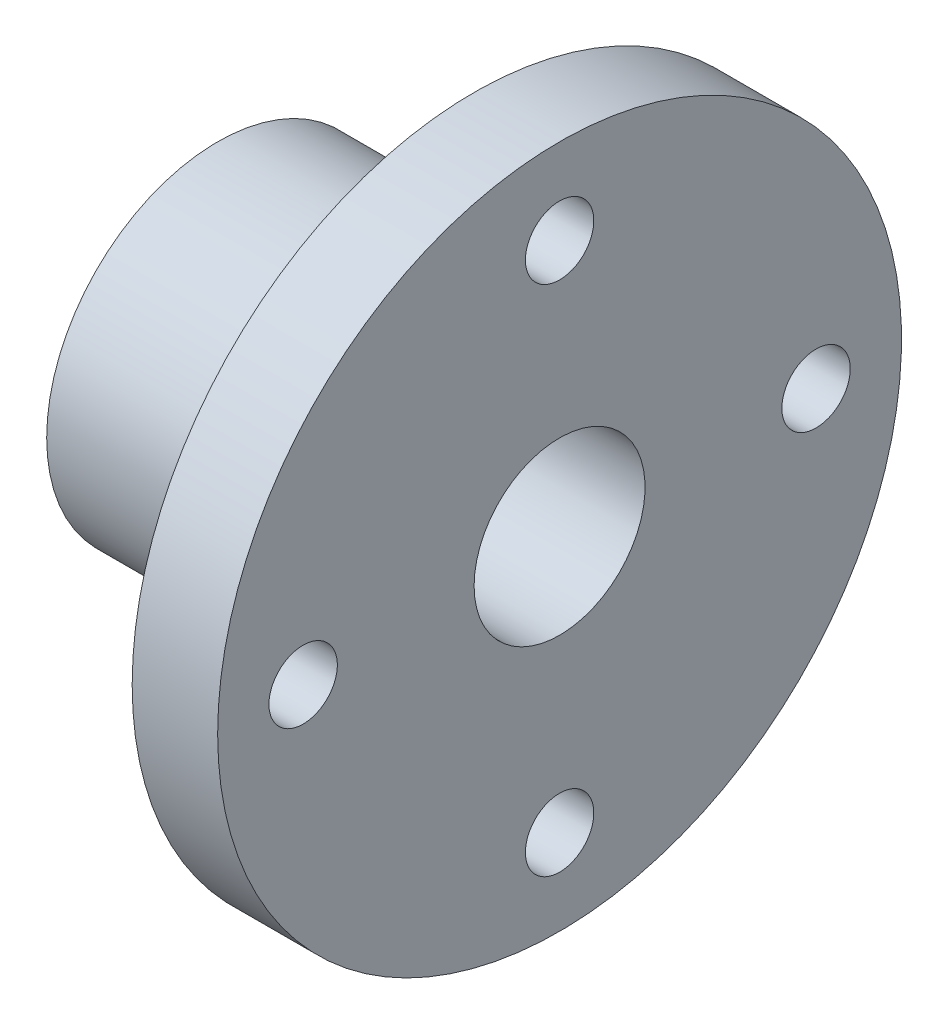
ISO-10303-21;
HEADER;
FILE_DESCRIPTION(('STEP AP214'),'2;1');
FILE_NAME('part.step','',(''),(''),'','','');
FILE_SCHEMA(('AUTOMOTIVE_DESIGN { 1 0 10303 214 1 1 1 1 }'));
ENDSEC;
DATA;
#1=APPLICATION_CONTEXT('core data for automotive mechanical design processes');
#2=APPLICATION_PROTOCOL_DEFINITION('international standard','automotive_design',2000,#1);
#3=PRODUCT_CONTEXT('',#1,'mechanical');
#4=PRODUCT('Part','Part','',(#3));
#5=PRODUCT_RELATED_PRODUCT_CATEGORY('part','',(#4));
#6=PRODUCT_DEFINITION_FORMATION('','',#4);
#7=PRODUCT_DEFINITION_CONTEXT('part definition',#1,'design');
#8=PRODUCT_DEFINITION('design','',#6,#7);
#9=PRODUCT_DEFINITION_SHAPE('','',#8);
#10=(LENGTH_UNIT() NAMED_UNIT(*) SI_UNIT(.MILLI.,.METRE.));
#11=(NAMED_UNIT(*) PLANE_ANGLE_UNIT() SI_UNIT($,.RADIAN.));
#12=(NAMED_UNIT(*) SI_UNIT($,.STERADIAN.) SOLID_ANGLE_UNIT());
#13=UNCERTAINTY_MEASURE_WITH_UNIT(LENGTH_MEASURE(1.E-05),#10,'distance_accuracy_value','');
#14=(GEOMETRIC_REPRESENTATION_CONTEXT(3) GLOBAL_UNCERTAINTY_ASSIGNED_CONTEXT((#13)) GLOBAL_UNIT_ASSIGNED_CONTEXT((#10,
#11,#12)) REPRESENTATION_CONTEXT('',''));
#15=CARTESIAN_POINT('',(0.,0.,0.));
#16=DIRECTION('',(0.,0.,1.));
#17=DIRECTION('',(1.,0.,0.));
#18=AXIS2_PLACEMENT_3D('',#15,#16,#17);
#19=CARTESIAN_POINT('',(11.4349315068493,0.,14.));
#20=DIRECTION('',(-1.,0.,0.));
#21=DIRECTION('',(0.,0.,1.));
#22=AXIS2_PLACEMENT_3D('',#19,#20,#21);
#23=PLANE('',#22);
#24=CARTESIAN_POINT('',(11.4349315068493,0.,-42.));
#25=DIRECTION('',(-1.,0.,0.));
#26=DIRECTION('',(0.,0.,1.));
#27=AXIS2_PLACEMENT_3D('',#24,#25,#26);
#28=CIRCLE('',#27,5.6);
#29=CARTESIAN_POINT('',(11.4349315068493,0.,-36.4));
#30=VERTEX_POINT('',#29);
#31=EDGE_CURVE('E84',#30,#30,#28,.F.);
#32=ORIENTED_EDGE('',*,*,#31,.F.);
#33=EDGE_LOOP('',(#32));
#34=FACE_BOUND('',#33,.T.);
#35=CARTESIAN_POINT('',(11.4349315068493,0.,42.));
#36=DIRECTION('',(-1.,0.,0.));
#37=DIRECTION('',(0.,0.,1.));
#38=AXIS2_PLACEMENT_3D('',#35,#36,#37);
#39=CIRCLE('',#38,5.6);
#40=CARTESIAN_POINT('',(11.4349315068493,0.,47.6));
#41=VERTEX_POINT('',#40);
#42=EDGE_CURVE('E70',#41,#41,#39,.F.);
#43=ORIENTED_EDGE('',*,*,#42,.F.);
#44=EDGE_LOOP('',(#43));
#45=FACE_BOUND('',#44,.T.);
#46=CARTESIAN_POINT('',(11.4349315068493,0.,0.));
#47=DIRECTION('',(-1.,0.,0.));
#48=DIRECTION('',(0.,0.,1.));
#49=AXIS2_PLACEMENT_3D('',#46,#47,#48);
#50=CIRCLE('',#49,56.);
#51=CARTESIAN_POINT('',(11.4349315068493,0.,56.));
#52=VERTEX_POINT('',#51);
#53=EDGE_CURVE('E51',#52,#52,#50,.T.);
#54=ORIENTED_EDGE('',*,*,#53,.F.);
#55=EDGE_LOOP('',(#54));
#56=FACE_BOUND('',#55,.T.);
#57=CARTESIAN_POINT('',(11.4349315068493,0.,0.));
#58=DIRECTION('',(-1.,0.,0.));
#59=DIRECTION('',(0.,0.,1.));
#60=AXIS2_PLACEMENT_3D('',#57,#58,#59);
#61=CIRCLE('',#60,14.);
#62=CARTESIAN_POINT('',(11.4349315068493,0.,14.));
#63=VERTEX_POINT('',#62);
#64=EDGE_CURVE('E10',#63,#63,#61,.T.);
#65=ORIENTED_EDGE('',*,*,#64,.T.);
#66=EDGE_LOOP('',(#65));
#67=FACE_BOUND('',#66,.T.);
#68=CARTESIAN_POINT('',(11.4349315068493,-42.,0.));
#69=DIRECTION('',(-1.,0.,0.));
#70=DIRECTION('',(0.,0.,1.));
#71=AXIS2_PLACEMENT_3D('',#68,#69,#70);
#72=CIRCLE('',#71,5.6);
#73=CARTESIAN_POINT('',(11.4349315068493,-42.,5.6));
#74=VERTEX_POINT('',#73);
#75=EDGE_CURVE('E77',#74,#74,#72,.F.);
#76=ORIENTED_EDGE('',*,*,#75,.F.);
#77=EDGE_LOOP('',(#76));
#78=FACE_BOUND('',#77,.T.);
#79=CARTESIAN_POINT('',(11.4349315068493,42.,0.));
#80=DIRECTION('',(-1.,0.,0.));
#81=DIRECTION('',(0.,0.,1.));
#82=AXIS2_PLACEMENT_3D('',#79,#80,#81);
#83=CIRCLE('',#82,5.6);
#84=CARTESIAN_POINT('',(11.4349315068493,42.,5.6));
#85=VERTEX_POINT('',#84);
#86=EDGE_CURVE('E91',#85,#85,#83,.F.);
#87=ORIENTED_EDGE('',*,*,#86,.F.);
#88=EDGE_LOOP('',(#87));
#89=FACE_BOUND('',#88,.T.);
#90=ADVANCED_FACE('F44',(#34,#45,#56,#67,#78,#89),#23,.F.);
#91=CARTESIAN_POINT('',(-2.5650684931507,0.,56.));
#92=DIRECTION('',(1.,0.,0.));
#93=DIRECTION('',(0.,0.,-1.));
#94=AXIS2_PLACEMENT_3D('',#91,#92,#93);
#95=PLANE('',#94);
#96=CARTESIAN_POINT('',(-2.5650684931507,0.,-42.));
#97=DIRECTION('',(1.,0.,0.));
#98=DIRECTION('',(0.,1.,0.));
#99=AXIS2_PLACEMENT_3D('',#96,#97,#98);
#100=CIRCLE('',#99,5.6);
#101=CARTESIAN_POINT('',(-2.5650684931507,5.6,-42.));
#102=VERTEX_POINT('',#101);
#103=EDGE_CURVE('E87',#102,#102,#100,.T.);
#104=ORIENTED_EDGE('',*,*,#103,.T.);
#105=EDGE_LOOP('',(#104));
#106=FACE_BOUND('',#105,.T.);
#107=CARTESIAN_POINT('',(-2.5650684931507,0.,42.));
#108=DIRECTION('',(1.,0.,0.));
#109=DIRECTION('',(0.,-1.,0.));
#110=AXIS2_PLACEMENT_3D('',#107,#108,#109);
#111=CIRCLE('',#110,5.6);
#112=CARTESIAN_POINT('',(-2.5650684931507,-5.6,42.));
#113=VERTEX_POINT('',#112);
#114=EDGE_CURVE('E73',#113,#113,#111,.T.);
#115=ORIENTED_EDGE('',*,*,#114,.T.);
#116=EDGE_LOOP('',(#115));
#117=FACE_BOUND('',#116,.T.);
#118=CARTESIAN_POINT('',(-2.56506849315069,0.,0.));
#119=DIRECTION('',(-1.,0.,0.));
#120=DIRECTION('',(0.,0.,1.));
#121=AXIS2_PLACEMENT_3D('',#118,#119,#120);
#122=CIRCLE('',#121,28.);
#123=CARTESIAN_POINT('',(-2.56506849315069,0.,28.));
#124=VERTEX_POINT('',#123);
#125=EDGE_CURVE('E59',#124,#124,#122,.T.);
#126=ORIENTED_EDGE('',*,*,#125,.F.);
#127=EDGE_LOOP('',(#126));
#128=FACE_BOUND('',#127,.T.);
#129=CARTESIAN_POINT('',(-2.56506849315069,0.,0.));
#130=DIRECTION('',(-1.,0.,0.));
#131=DIRECTION('',(0.,0.,1.));
#132=AXIS2_PLACEMENT_3D('',#129,#130,#131);
#133=CIRCLE('',#132,56.);
#134=CARTESIAN_POINT('',(-2.56506849315069,0.,56.));
#135=VERTEX_POINT('',#134);
#136=EDGE_CURVE('E55',#135,#135,#133,.T.);
#137=ORIENTED_EDGE('',*,*,#136,.T.);
#138=EDGE_LOOP('',(#137));
#139=FACE_BOUND('',#138,.T.);
#140=CARTESIAN_POINT('',(-2.5650684931507,-42.,0.));
#141=DIRECTION('',(1.,0.,0.));
#142=DIRECTION('',(0.,0.,-1.));
#143=AXIS2_PLACEMENT_3D('',#140,#141,#142);
#144=CIRCLE('',#143,5.6);
#145=CARTESIAN_POINT('',(-2.5650684931507,-42.,-5.6));
#146=VERTEX_POINT('',#145);
#147=EDGE_CURVE('E80',#146,#146,#144,.T.);
#148=ORIENTED_EDGE('',*,*,#147,.T.);
#149=EDGE_LOOP('',(#148));
#150=FACE_BOUND('',#149,.T.);
#151=CARTESIAN_POINT('',(-2.5650684931507,42.,0.));
#152=DIRECTION('',(1.,0.,0.));
#153=DIRECTION('',(0.,0.,1.));
#154=AXIS2_PLACEMENT_3D('',#151,#152,#153);
#155=CIRCLE('',#154,5.6);
#156=CARTESIAN_POINT('',(-2.5650684931507,42.,5.6));
#157=VERTEX_POINT('',#156);
#158=EDGE_CURVE('E94',#157,#157,#155,.T.);
#159=ORIENTED_EDGE('',*,*,#158,.T.);
#160=EDGE_LOOP('',(#159));
#161=FACE_BOUND('',#160,.T.);
#162=ADVANCED_FACE('F100',(#106,#117,#128,#139,#150,#161),#95,.F.);
#163=CARTESIAN_POINT('',(-156.565068493151,0.,0.));
#164=DIRECTION('',(-1.,0.,0.));
#165=DIRECTION('',(0.,0.,1.));
#166=AXIS2_PLACEMENT_3D('',#163,#164,#165);
#167=CYLINDRICAL_SURFACE('',#166,14.);
#168=ORIENTED_EDGE('',*,*,#64,.F.);
#169=EDGE_LOOP('',(#168));
#170=FACE_BOUND('',#169,.T.);
#171=CARTESIAN_POINT('',(-44.5650684931507,0.,0.));
#172=DIRECTION('',(-1.,0.,0.));
#173=DIRECTION('',(0.,0.,1.));
#174=AXIS2_PLACEMENT_3D('',#171,#172,#173);
#175=CIRCLE('',#174,14.);
#176=CARTESIAN_POINT('',(-44.5650684931507,0.,14.));
#177=VERTEX_POINT('',#176);
#178=EDGE_CURVE('E67',#177,#177,#175,.T.);
#179=ORIENTED_EDGE('',*,*,#178,.T.);
#180=EDGE_LOOP('',(#179));
#181=FACE_BOUND('',#180,.T.);
#182=ADVANCED_FACE('F46',(#170,#181),#167,.F.);
#183=CARTESIAN_POINT('',(-156.565068493151,0.,0.));
#184=DIRECTION('',(-1.,0.,0.));
#185=DIRECTION('',(0.,0.,1.));
#186=AXIS2_PLACEMENT_3D('',#183,#184,#185);
#187=CYLINDRICAL_SURFACE('',#186,56.);
#188=ORIENTED_EDGE('',*,*,#136,.F.);
#189=EDGE_LOOP('',(#188));
#190=FACE_BOUND('',#189,.T.);
#191=ORIENTED_EDGE('',*,*,#53,.T.);
#192=EDGE_LOOP('',(#191));
#193=FACE_BOUND('',#192,.T.);
#194=ADVANCED_FACE('F119',(#190,#193),#187,.T.);
#195=CARTESIAN_POINT('',(-156.565068493151,0.,0.));
#196=DIRECTION('',(-1.,0.,0.));
#197=DIRECTION('',(0.,0.,1.));
#198=AXIS2_PLACEMENT_3D('',#195,#196,#197);
#199=CYLINDRICAL_SURFACE('',#198,28.);
#200=CARTESIAN_POINT('',(-44.5650684931507,0.,0.));
#201=DIRECTION('',(-1.,0.,0.));
#202=DIRECTION('',(0.,0.,1.));
#203=AXIS2_PLACEMENT_3D('',#200,#201,#202);
#204=CIRCLE('',#203,28.);
#205=CARTESIAN_POINT('',(-44.5650684931507,0.,28.));
#206=VERTEX_POINT('',#205);
#207=EDGE_CURVE('E64',#206,#206,#204,.T.);
#208=ORIENTED_EDGE('',*,*,#207,.F.);
#209=EDGE_LOOP('',(#208));
#210=FACE_BOUND('',#209,.T.);
#211=ORIENTED_EDGE('',*,*,#125,.T.);
#212=EDGE_LOOP('',(#211));
#213=FACE_BOUND('',#212,.T.);
#214=ADVANCED_FACE('F121',(#210,#213),#199,.T.);
#215=CARTESIAN_POINT('',(-44.5650684931507,0.,28.));
#216=DIRECTION('',(1.,0.,0.));
#217=DIRECTION('',(0.,0.,-1.));
#218=AXIS2_PLACEMENT_3D('',#215,#216,#217);
#219=PLANE('',#218);
#220=ORIENTED_EDGE('',*,*,#178,.F.);
#221=EDGE_LOOP('',(#220));
#222=FACE_BOUND('',#221,.T.);
#223=ORIENTED_EDGE('',*,*,#207,.T.);
#224=EDGE_LOOP('',(#223));
#225=FACE_BOUND('',#224,.T.);
#226=ADVANCED_FACE('F126',(#222,#225),#219,.F.);
#227=CARTESIAN_POINT('',(130.784931506849,0.,42.));
#228=DIRECTION('',(-1.,0.,0.));
#229=DIRECTION('',(0.,0.,1.));
#230=AXIS2_PLACEMENT_3D('',#227,#228,#229);
#231=CYLINDRICAL_SURFACE('',#230,5.6);
#232=ORIENTED_EDGE('',*,*,#114,.F.);
#233=EDGE_LOOP('',(#232));
#234=FACE_BOUND('',#233,.T.);
#235=ORIENTED_EDGE('',*,*,#42,.T.);
#236=EDGE_LOOP('',(#235));
#237=FACE_BOUND('',#236,.T.);
#238=ADVANCED_FACE('F130',(#234,#237),#231,.F.);
#239=CARTESIAN_POINT('',(130.784931506849,-42.,0.));
#240=DIRECTION('',(-1.,0.,0.));
#241=DIRECTION('',(0.,0.,1.));
#242=AXIS2_PLACEMENT_3D('',#239,#240,#241);
#243=CYLINDRICAL_SURFACE('',#242,5.6);
#244=ORIENTED_EDGE('',*,*,#147,.F.);
#245=EDGE_LOOP('',(#244));
#246=FACE_BOUND('',#245,.T.);
#247=ORIENTED_EDGE('',*,*,#75,.T.);
#248=EDGE_LOOP('',(#247));
#249=FACE_BOUND('',#248,.T.);
#250=ADVANCED_FACE('F134',(#246,#249),#243,.F.);
#251=CARTESIAN_POINT('',(130.784931506849,0.,-42.));
#252=DIRECTION('',(-1.,0.,0.));
#253=DIRECTION('',(0.,0.,1.));
#254=AXIS2_PLACEMENT_3D('',#251,#252,#253);
#255=CYLINDRICAL_SURFACE('',#254,5.6);
#256=ORIENTED_EDGE('',*,*,#103,.F.);
#257=EDGE_LOOP('',(#256));
#258=FACE_BOUND('',#257,.T.);
#259=ORIENTED_EDGE('',*,*,#31,.T.);
#260=EDGE_LOOP('',(#259));
#261=FACE_BOUND('',#260,.T.);
#262=ADVANCED_FACE('F105',(#258,#261),#255,.F.);
#263=CARTESIAN_POINT('',(130.784931506849,42.,0.));
#264=DIRECTION('',(-1.,0.,0.));
#265=DIRECTION('',(0.,0.,1.));
#266=AXIS2_PLACEMENT_3D('',#263,#264,#265);
#267=CYLINDRICAL_SURFACE('',#266,5.6);
#268=ORIENTED_EDGE('',*,*,#158,.F.);
#269=EDGE_LOOP('',(#268));
#270=FACE_BOUND('',#269,.T.);
#271=ORIENTED_EDGE('',*,*,#86,.T.);
#272=EDGE_LOOP('',(#271));
#273=FACE_BOUND('',#272,.T.);
#274=ADVANCED_FACE('F102',(#270,#273),#267,.F.);
#275=CLOSED_SHELL('',(#90,#162,#182,#194,#214,#226,#238,#250,#262,#274));
#276=MANIFOLD_SOLID_BREP('B2',#275);
#277=ADVANCED_BREP_SHAPE_REPRESENTATION('',(#18,#276),#14);
#278=SHAPE_DEFINITION_REPRESENTATION(#9,#277);
ENDSEC;
END-ISO-10303-21;
